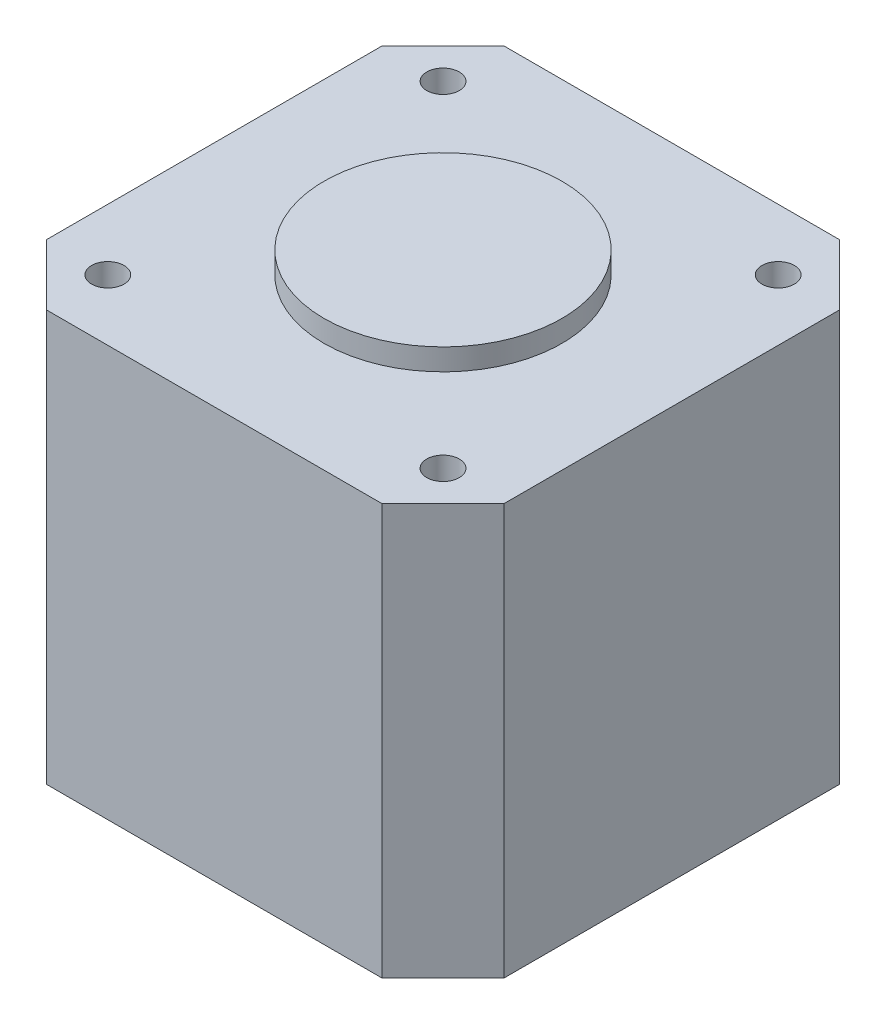
ISO-10303-21;
HEADER;
FILE_DESCRIPTION(('STEP AP214'),'2;1');
FILE_NAME('part.step','',(''),(''),'','','');
FILE_SCHEMA(('AUTOMOTIVE_DESIGN { 1 0 10303 214 1 1 1 1 }'));
ENDSEC;
DATA;
#1=APPLICATION_CONTEXT('core data for automotive mechanical design processes');
#2=APPLICATION_PROTOCOL_DEFINITION('international standard','automotive_design',2000,#1);
#3=PRODUCT_CONTEXT('',#1,'mechanical');
#4=PRODUCT('Part','Part','',(#3));
#5=PRODUCT_RELATED_PRODUCT_CATEGORY('part','',(#4));
#6=PRODUCT_DEFINITION_FORMATION('','',#4);
#7=PRODUCT_DEFINITION_CONTEXT('part definition',#1,'design');
#8=PRODUCT_DEFINITION('design','',#6,#7);
#9=PRODUCT_DEFINITION_SHAPE('','',#8);
#10=(LENGTH_UNIT() NAMED_UNIT(*) SI_UNIT(.MILLI.,.METRE.));
#11=(NAMED_UNIT(*) PLANE_ANGLE_UNIT() SI_UNIT($,.RADIAN.));
#12=(NAMED_UNIT(*) SI_UNIT($,.STERADIAN.) SOLID_ANGLE_UNIT());
#13=UNCERTAINTY_MEASURE_WITH_UNIT(LENGTH_MEASURE(1.E-05),#10,'distance_accuracy_value','');
#14=(GEOMETRIC_REPRESENTATION_CONTEXT(3) GLOBAL_UNCERTAINTY_ASSIGNED_CONTEXT((#13)) GLOBAL_UNIT_ASSIGNED_CONTEXT((#10,
#11,#12)) REPRESENTATION_CONTEXT('',''));
#15=CARTESIAN_POINT('',(0.,0.,0.));
#16=DIRECTION('',(0.,0.,1.));
#17=DIRECTION('',(1.,0.,0.));
#18=AXIS2_PLACEMENT_3D('',#15,#16,#17);
#19=CARTESIAN_POINT('',(-15.5,38.,-21.15));
#20=DIRECTION('',(0.,0.,1.));
#21=DIRECTION('',(1.,0.,0.));
#22=AXIS2_PLACEMENT_3D('',#19,#20,#21);
#23=PLANE('',#22);
#24=DIRECTION('',(-1.,0.,0.));
#25=VECTOR('',#24,1.);
#26=CARTESIAN_POINT('',(-15.5,0.,-21.15));
#27=LINE('',#26,#25);
#28=CARTESIAN_POINT('',(15.5,0.,-21.15));
#29=VERTEX_POINT('',#28);
#30=CARTESIAN_POINT('',(-15.5,0.,-21.15));
#31=VERTEX_POINT('',#30);
#32=EDGE_CURVE('E136',#29,#31,#27,.T.);
#33=ORIENTED_EDGE('',*,*,#32,.T.);
#34=DIRECTION('',(0.,-1.,0.));
#35=VECTOR('',#34,1.);
#36=CARTESIAN_POINT('',(-15.5,38.,-21.15));
#37=LINE('',#36,#35);
#38=CARTESIAN_POINT('',(-15.5,38.,-21.15));
#39=VERTEX_POINT('',#38);
#40=EDGE_CURVE('E41',#39,#31,#37,.T.);
#41=ORIENTED_EDGE('',*,*,#40,.F.);
#42=DIRECTION('',(-1.,0.,0.));
#43=VECTOR('',#42,1.);
#44=CARTESIAN_POINT('',(-15.5,38.,-21.15));
#45=LINE('',#44,#43);
#46=CARTESIAN_POINT('',(15.5,38.,-21.15));
#47=VERTEX_POINT('',#46);
#48=EDGE_CURVE('E151',#47,#39,#45,.T.);
#49=ORIENTED_EDGE('',*,*,#48,.F.);
#50=DIRECTION('',(0.,-1.,0.));
#51=VECTOR('',#50,1.);
#52=CARTESIAN_POINT('',(15.5,38.,-21.15));
#53=LINE('',#52,#51);
#54=EDGE_CURVE('E132',#47,#29,#53,.T.);
#55=ORIENTED_EDGE('',*,*,#54,.T.);
#56=EDGE_LOOP('',(#33,#41,#49,#55));
#57=FACE_BOUND('',#56,.T.);
#58=ADVANCED_FACE('F38',(#57),#23,.F.);
#59=CARTESIAN_POINT('',(-15.5,38.,-21.15));
#60=DIRECTION('',(0.707106781186548,0.,0.707106781186548));
#61=DIRECTION('',(0.707106781186548,0.,-0.707106781186548));
#62=AXIS2_PLACEMENT_3D('',#59,#60,#61);
#63=PLANE('',#62);
#64=DIRECTION('',(-0.707106781186547,0.,0.707106781186547));
#65=VECTOR('',#64,1.);
#66=CARTESIAN_POINT('',(-15.5,0.,-21.15));
#67=LINE('',#66,#65);
#68=CARTESIAN_POINT('',(-21.15,0.,-15.5));
#69=VERTEX_POINT('',#68);
#70=EDGE_CURVE('E139',#31,#69,#67,.T.);
#71=ORIENTED_EDGE('',*,*,#70,.T.);
#72=DIRECTION('',(0.,-1.,0.));
#73=VECTOR('',#72,1.);
#74=CARTESIAN_POINT('',(-21.15,38.,-15.5));
#75=LINE('',#74,#73);
#76=CARTESIAN_POINT('',(-21.15,38.,-15.5));
#77=VERTEX_POINT('',#76);
#78=EDGE_CURVE('E160',#77,#69,#75,.T.);
#79=ORIENTED_EDGE('',*,*,#78,.F.);
#80=DIRECTION('',(-0.707106781186547,0.,0.707106781186547));
#81=VECTOR('',#80,1.);
#82=CARTESIAN_POINT('',(-15.5,38.,-21.15));
#83=LINE('',#82,#81);
#84=EDGE_CURVE('E99',#39,#77,#83,.T.);
#85=ORIENTED_EDGE('',*,*,#84,.F.);
#86=ORIENTED_EDGE('',*,*,#40,.T.);
#87=EDGE_LOOP('',(#71,#79,#85,#86));
#88=FACE_BOUND('',#87,.T.);
#89=ADVANCED_FACE('F166',(#88),#63,.F.);
#90=CARTESIAN_POINT('',(-21.15,38.,-15.5));
#91=DIRECTION('',(1.,0.,0.));
#92=DIRECTION('',(0.,0.,-1.));
#93=AXIS2_PLACEMENT_3D('',#90,#91,#92);
#94=PLANE('',#93);
#95=DIRECTION('',(0.,0.,1.));
#96=VECTOR('',#95,1.);
#97=CARTESIAN_POINT('',(-21.15,0.,-15.5));
#98=LINE('',#97,#96);
#99=CARTESIAN_POINT('',(-21.15,0.,15.5));
#100=VERTEX_POINT('',#99);
#101=EDGE_CURVE('E142',#69,#100,#98,.T.);
#102=ORIENTED_EDGE('',*,*,#101,.T.);
#103=DIRECTION('',(0.,-1.,0.));
#104=VECTOR('',#103,1.);
#105=CARTESIAN_POINT('',(-21.15,38.,15.5));
#106=LINE('',#105,#104);
#107=CARTESIAN_POINT('',(-21.15,38.,15.5));
#108=VERTEX_POINT('',#107);
#109=EDGE_CURVE('E158',#108,#100,#106,.T.);
#110=ORIENTED_EDGE('',*,*,#109,.F.);
#111=DIRECTION('',(0.,0.,1.));
#112=VECTOR('',#111,1.);
#113=CARTESIAN_POINT('',(-21.15,38.,-15.5));
#114=LINE('',#113,#112);
#115=EDGE_CURVE('E181',#77,#108,#114,.T.);
#116=ORIENTED_EDGE('',*,*,#115,.F.);
#117=ORIENTED_EDGE('',*,*,#78,.T.);
#118=EDGE_LOOP('',(#102,#110,#116,#117));
#119=FACE_BOUND('',#118,.T.);
#120=ADVANCED_FACE('F175',(#119),#94,.F.);
#121=CARTESIAN_POINT('',(-21.15,38.,15.5));
#122=DIRECTION('',(0.707106781186547,0.,-0.707106781186548));
#123=DIRECTION('',(-0.707106781186548,0.,-0.707106781186547));
#124=AXIS2_PLACEMENT_3D('',#121,#122,#123);
#125=PLANE('',#124);
#126=DIRECTION('',(0.707106781186548,0.,0.707106781186547));
#127=VECTOR('',#126,1.);
#128=CARTESIAN_POINT('',(-21.15,0.,15.5));
#129=LINE('',#128,#127);
#130=CARTESIAN_POINT('',(-15.5,0.,21.15));
#131=VERTEX_POINT('',#130);
#132=EDGE_CURVE('E144',#100,#131,#129,.T.);
#133=ORIENTED_EDGE('',*,*,#132,.T.);
#134=DIRECTION('',(0.,-1.,0.));
#135=VECTOR('',#134,1.);
#136=CARTESIAN_POINT('',(-15.5,38.,21.15));
#137=LINE('',#136,#135);
#138=CARTESIAN_POINT('',(-15.5,38.,21.15));
#139=VERTEX_POINT('',#138);
#140=EDGE_CURVE('E155',#139,#131,#137,.T.);
#141=ORIENTED_EDGE('',*,*,#140,.F.);
#142=DIRECTION('',(0.707106781186548,0.,0.707106781186547));
#143=VECTOR('',#142,1.);
#144=CARTESIAN_POINT('',(-21.15,38.,15.5));
#145=LINE('',#144,#143);
#146=EDGE_CURVE('E180',#108,#139,#145,.T.);
#147=ORIENTED_EDGE('',*,*,#146,.F.);
#148=ORIENTED_EDGE('',*,*,#109,.T.);
#149=EDGE_LOOP('',(#133,#141,#147,#148));
#150=FACE_BOUND('',#149,.T.);
#151=ADVANCED_FACE('F178',(#150),#125,.F.);
#152=CARTESIAN_POINT('',(-15.5,38.,21.15));
#153=DIRECTION('',(0.,0.,-1.));
#154=DIRECTION('',(-1.,0.,0.));
#155=AXIS2_PLACEMENT_3D('',#152,#153,#154);
#156=PLANE('',#155);
#157=DIRECTION('',(1.,0.,0.));
#158=VECTOR('',#157,1.);
#159=CARTESIAN_POINT('',(-15.5,0.,21.15));
#160=LINE('',#159,#158);
#161=CARTESIAN_POINT('',(15.5,0.,21.15));
#162=VERTEX_POINT('',#161);
#163=EDGE_CURVE('E146',#131,#162,#160,.T.);
#164=ORIENTED_EDGE('',*,*,#163,.T.);
#165=DIRECTION('',(0.,-1.,0.));
#166=VECTOR('',#165,1.);
#167=CARTESIAN_POINT('',(15.5,38.,21.15));
#168=LINE('',#167,#166);
#169=CARTESIAN_POINT('',(15.5,38.,21.15));
#170=VERTEX_POINT('',#169);
#171=EDGE_CURVE('E127',#170,#162,#168,.T.);
#172=ORIENTED_EDGE('',*,*,#171,.F.);
#173=DIRECTION('',(1.,0.,0.));
#174=VECTOR('',#173,1.);
#175=CARTESIAN_POINT('',(-15.5,38.,21.15));
#176=LINE('',#175,#174);
#177=EDGE_CURVE('E118',#139,#170,#176,.T.);
#178=ORIENTED_EDGE('',*,*,#177,.F.);
#179=ORIENTED_EDGE('',*,*,#140,.T.);
#180=EDGE_LOOP('',(#164,#172,#178,#179));
#181=FACE_BOUND('',#180,.T.);
#182=ADVANCED_FACE('F257',(#181),#156,.F.);
#183=CARTESIAN_POINT('',(15.5,38.,21.15));
#184=DIRECTION('',(-0.707106781186548,0.,-0.707106781186547));
#185=DIRECTION('',(-0.707106781186547,0.,0.707106781186548));
#186=AXIS2_PLACEMENT_3D('',#183,#184,#185);
#187=PLANE('',#186);
#188=DIRECTION('',(0.707106781186547,0.,-0.707106781186548));
#189=VECTOR('',#188,1.);
#190=CARTESIAN_POINT('',(15.5,0.,21.15));
#191=LINE('',#190,#189);
#192=CARTESIAN_POINT('',(21.15,0.,15.5));
#193=VERTEX_POINT('',#192);
#194=EDGE_CURVE('E126',#162,#193,#191,.T.);
#195=ORIENTED_EDGE('',*,*,#194,.T.);
#196=DIRECTION('',(0.,-1.,0.));
#197=VECTOR('',#196,1.);
#198=CARTESIAN_POINT('',(21.15,38.,15.5));
#199=LINE('',#198,#197);
#200=CARTESIAN_POINT('',(21.15,38.,15.5));
#201=VERTEX_POINT('',#200);
#202=EDGE_CURVE('E123',#201,#193,#199,.T.);
#203=ORIENTED_EDGE('',*,*,#202,.F.);
#204=DIRECTION('',(0.707106781186547,0.,-0.707106781186548));
#205=VECTOR('',#204,1.);
#206=CARTESIAN_POINT('',(15.5,38.,21.15));
#207=LINE('',#206,#205);
#208=EDGE_CURVE('E112',#170,#201,#207,.T.);
#209=ORIENTED_EDGE('',*,*,#208,.F.);
#210=ORIENTED_EDGE('',*,*,#171,.T.);
#211=EDGE_LOOP('',(#195,#203,#209,#210));
#212=FACE_BOUND('',#211,.T.);
#213=ADVANCED_FACE('F124',(#212),#187,.F.);
#214=CARTESIAN_POINT('',(21.15,38.,-15.5));
#215=DIRECTION('',(-1.,0.,0.));
#216=DIRECTION('',(0.,0.,1.));
#217=AXIS2_PLACEMENT_3D('',#214,#215,#216);
#218=PLANE('',#217);
#219=DIRECTION('',(0.,0.,-1.));
#220=VECTOR('',#219,1.);
#221=CARTESIAN_POINT('',(21.15,0.,-15.5));
#222=LINE('',#221,#220);
#223=CARTESIAN_POINT('',(21.15,0.,-15.5));
#224=VERTEX_POINT('',#223);
#225=EDGE_CURVE('E84',#193,#224,#222,.T.);
#226=ORIENTED_EDGE('',*,*,#225,.T.);
#227=DIRECTION('',(0.,-1.,0.));
#228=VECTOR('',#227,1.);
#229=CARTESIAN_POINT('',(21.15,38.,-15.5));
#230=LINE('',#229,#228);
#231=CARTESIAN_POINT('',(21.15,38.,-15.5));
#232=VERTEX_POINT('',#231);
#233=EDGE_CURVE('E128',#232,#224,#230,.T.);
#234=ORIENTED_EDGE('',*,*,#233,.F.);
#235=DIRECTION('',(0.,0.,-1.));
#236=VECTOR('',#235,1.);
#237=CARTESIAN_POINT('',(21.15,38.,-15.5));
#238=LINE('',#237,#236);
#239=EDGE_CURVE('E116',#201,#232,#238,.T.);
#240=ORIENTED_EDGE('',*,*,#239,.F.);
#241=ORIENTED_EDGE('',*,*,#202,.T.);
#242=EDGE_LOOP('',(#226,#234,#240,#241));
#243=FACE_BOUND('',#242,.T.);
#244=ADVANCED_FACE('F130',(#243),#218,.F.);
#245=CARTESIAN_POINT('',(15.5,38.,-21.15));
#246=DIRECTION('',(-0.707106781186548,0.,0.707106781186548));
#247=DIRECTION('',(0.707106781186548,0.,0.707106781186547));
#248=AXIS2_PLACEMENT_3D('',#245,#246,#247);
#249=PLANE('',#248);
#250=DIRECTION('',(-0.707106781186548,0.,-0.707106781186547));
#251=VECTOR('',#250,1.);
#252=CARTESIAN_POINT('',(15.5,0.,-21.15));
#253=LINE('',#252,#251);
#254=EDGE_CURVE('E90',#224,#29,#253,.T.);
#255=ORIENTED_EDGE('',*,*,#254,.T.);
#256=ORIENTED_EDGE('',*,*,#54,.F.);
#257=DIRECTION('',(-0.707106781186548,0.,-0.707106781186547));
#258=VECTOR('',#257,1.);
#259=CARTESIAN_POINT('',(15.5,38.,-21.15));
#260=LINE('',#259,#258);
#261=EDGE_CURVE('E55',#232,#47,#260,.T.);
#262=ORIENTED_EDGE('',*,*,#261,.F.);
#263=ORIENTED_EDGE('',*,*,#233,.T.);
#264=EDGE_LOOP('',(#255,#256,#262,#263));
#265=FACE_BOUND('',#264,.T.);
#266=ADVANCED_FACE('F225',(#265),#249,.F.);
#267=CARTESIAN_POINT('',(0.,38.,0.));
#268=DIRECTION('',(0.,-1.,0.));
#269=DIRECTION('',(0.,0.,-1.));
#270=AXIS2_PLACEMENT_3D('',#267,#268,#269);
#271=PLANE('',#270);
#272=CARTESIAN_POINT('',(-15.5,38.,15.5));
#273=DIRECTION('',(0.,1.,0.));
#274=DIRECTION('',(0.,0.,1.));
#275=AXIS2_PLACEMENT_3D('',#272,#273,#274);
#276=CIRCLE('',#275,1.5);
#277=CARTESIAN_POINT('',(-15.5,38.,17.));
#278=VERTEX_POINT('',#277);
#279=EDGE_CURVE('E196',#278,#278,#276,.T.);
#280=ORIENTED_EDGE('',*,*,#279,.F.);
#281=EDGE_LOOP('',(#280));
#282=FACE_BOUND('',#281,.T.);
#283=CARTESIAN_POINT('',(15.5,38.,15.5));
#284=DIRECTION('',(0.,1.,0.));
#285=DIRECTION('',(0.,0.,1.));
#286=AXIS2_PLACEMENT_3D('',#283,#284,#285);
#287=CIRCLE('',#286,1.5);
#288=CARTESIAN_POINT('',(15.5,38.,17.));
#289=VERTEX_POINT('',#288);
#290=EDGE_CURVE('E202',#289,#289,#287,.T.);
#291=ORIENTED_EDGE('',*,*,#290,.F.);
#292=EDGE_LOOP('',(#291));
#293=FACE_BOUND('',#292,.T.);
#294=CARTESIAN_POINT('',(15.5,38.,-15.5));
#295=DIRECTION('',(0.,1.,0.));
#296=DIRECTION('',(0.,0.,1.));
#297=AXIS2_PLACEMENT_3D('',#294,#295,#296);
#298=CIRCLE('',#297,1.5);
#299=CARTESIAN_POINT('',(15.5,38.,-14.));
#300=VERTEX_POINT('',#299);
#301=EDGE_CURVE('E208',#300,#300,#298,.T.);
#302=ORIENTED_EDGE('',*,*,#301,.F.);
#303=EDGE_LOOP('',(#302));
#304=FACE_BOUND('',#303,.T.);
#305=CARTESIAN_POINT('',(-15.5,38.,-15.5));
#306=DIRECTION('',(0.,1.,0.));
#307=DIRECTION('',(0.,0.,1.));
#308=AXIS2_PLACEMENT_3D('',#305,#306,#307);
#309=CIRCLE('',#308,1.5);
#310=CARTESIAN_POINT('',(-15.5,38.,-14.));
#311=VERTEX_POINT('',#310);
#312=EDGE_CURVE('E190',#311,#311,#309,.T.);
#313=ORIENTED_EDGE('',*,*,#312,.F.);
#314=EDGE_LOOP('',(#313));
#315=FACE_BOUND('',#314,.T.);
#316=CARTESIAN_POINT('',(0.,38.,0.));
#317=DIRECTION('',(0.,1.,0.));
#318=DIRECTION('',(0.,0.,1.));
#319=AXIS2_PLACEMENT_3D('',#316,#317,#318);
#320=CIRCLE('',#319,11.);
#321=CARTESIAN_POINT('',(0.,38.,11.));
#322=VERTEX_POINT('',#321);
#323=EDGE_CURVE('E11',#322,#322,#320,.T.);
#324=ORIENTED_EDGE('',*,*,#323,.F.);
#325=EDGE_LOOP('',(#324));
#326=FACE_BOUND('',#325,.T.);
#327=ORIENTED_EDGE('',*,*,#48,.T.);
#328=ORIENTED_EDGE('',*,*,#84,.T.);
#329=ORIENTED_EDGE('',*,*,#115,.T.);
#330=ORIENTED_EDGE('',*,*,#146,.T.);
#331=ORIENTED_EDGE('',*,*,#177,.T.);
#332=ORIENTED_EDGE('',*,*,#208,.T.);
#333=ORIENTED_EDGE('',*,*,#239,.T.);
#334=ORIENTED_EDGE('',*,*,#261,.T.);
#335=EDGE_LOOP('',(#327,#328,#329,#330,#331,#332,#333,#334));
#336=FACE_BOUND('',#335,.T.);
#337=ADVANCED_FACE('F114',(#282,#293,#304,#315,#326,#336),#271,.F.);
#338=CARTESIAN_POINT('',(0.,0.,0.));
#339=DIRECTION('',(0.,-1.,0.));
#340=DIRECTION('',(0.,0.,-1.));
#341=AXIS2_PLACEMENT_3D('',#338,#339,#340);
#342=PLANE('',#341);
#343=ORIENTED_EDGE('',*,*,#32,.F.);
#344=ORIENTED_EDGE('',*,*,#254,.F.);
#345=ORIENTED_EDGE('',*,*,#225,.F.);
#346=ORIENTED_EDGE('',*,*,#194,.F.);
#347=ORIENTED_EDGE('',*,*,#163,.F.);
#348=ORIENTED_EDGE('',*,*,#132,.F.);
#349=ORIENTED_EDGE('',*,*,#101,.F.);
#350=ORIENTED_EDGE('',*,*,#70,.F.);
#351=EDGE_LOOP('',(#343,#344,#345,#346,#347,#348,#349,#350));
#352=FACE_BOUND('',#351,.T.);
#353=ADVANCED_FACE('F171',(#352),#342,.T.);
#354=CARTESIAN_POINT('',(0.,40.,0.));
#355=DIRECTION('',(0.,-1.,0.));
#356=DIRECTION('',(0.,0.,-1.));
#357=AXIS2_PLACEMENT_3D('',#354,#355,#356);
#358=CYLINDRICAL_SURFACE('',#357,11.);
#359=CARTESIAN_POINT('',(0.,40.,0.));
#360=DIRECTION('',(0.,1.,0.));
#361=DIRECTION('',(0.,0.,1.));
#362=AXIS2_PLACEMENT_3D('',#359,#360,#361);
#363=CIRCLE('',#362,11.);
#364=CARTESIAN_POINT('',(0.,40.,11.));
#365=VERTEX_POINT('',#364);
#366=EDGE_CURVE('E140',#365,#365,#363,.T.);
#367=ORIENTED_EDGE('',*,*,#366,.F.);
#368=EDGE_LOOP('',(#367));
#369=FACE_BOUND('',#368,.T.);
#370=ORIENTED_EDGE('',*,*,#323,.T.);
#371=EDGE_LOOP('',(#370));
#372=FACE_BOUND('',#371,.T.);
#373=ADVANCED_FACE('F232',(#369,#372),#358,.T.);
#374=CARTESIAN_POINT('',(0.,40.,0.));
#375=DIRECTION('',(0.,1.,0.));
#376=DIRECTION('',(0.,0.,1.));
#377=AXIS2_PLACEMENT_3D('',#374,#375,#376);
#378=PLANE('',#377);
#379=ORIENTED_EDGE('',*,*,#366,.T.);
#380=EDGE_LOOP('',(#379));
#381=FACE_BOUND('',#380,.T.);
#382=ADVANCED_FACE('F234',(#381),#378,.T.);
#383=CARTESIAN_POINT('',(-15.5,33.,-15.5));
#384=DIRECTION('',(0.,1.,0.));
#385=DIRECTION('',(0.,0.,1.));
#386=AXIS2_PLACEMENT_3D('',#383,#384,#385);
#387=CYLINDRICAL_SURFACE('',#386,1.5);
#388=CARTESIAN_POINT('',(-15.5,33.,-15.5));
#389=DIRECTION('',(0.,1.,0.));
#390=DIRECTION('',(0.,0.,1.));
#391=AXIS2_PLACEMENT_3D('',#388,#389,#390);
#392=CIRCLE('',#391,1.5);
#393=CARTESIAN_POINT('',(-15.5,33.,-14.));
#394=VERTEX_POINT('',#393);
#395=EDGE_CURVE('E189',#394,#394,#392,.T.);
#396=ORIENTED_EDGE('',*,*,#395,.F.);
#397=EDGE_LOOP('',(#396));
#398=FACE_BOUND('',#397,.T.);
#399=ORIENTED_EDGE('',*,*,#312,.T.);
#400=EDGE_LOOP('',(#399));
#401=FACE_BOUND('',#400,.T.);
#402=ADVANCED_FACE('F241',(#398,#401),#387,.F.);
#403=CARTESIAN_POINT('',(-15.5,33.,-15.5));
#404=DIRECTION('',(0.,1.,0.));
#405=DIRECTION('',(0.,0.,1.));
#406=AXIS2_PLACEMENT_3D('',#403,#404,#405);
#407=PLANE('',#406);
#408=ORIENTED_EDGE('',*,*,#395,.T.);
#409=EDGE_LOOP('',(#408));
#410=FACE_BOUND('',#409,.T.);
#411=ADVANCED_FACE('F219',(#410),#407,.T.);
#412=CARTESIAN_POINT('',(15.5,33.,-15.5));
#413=DIRECTION('',(0.,1.,0.));
#414=DIRECTION('',(0.,0.,1.));
#415=AXIS2_PLACEMENT_3D('',#412,#413,#414);
#416=CYLINDRICAL_SURFACE('',#415,1.5);
#417=CARTESIAN_POINT('',(15.5,33.,-15.5));
#418=DIRECTION('',(0.,1.,0.));
#419=DIRECTION('',(0.,0.,1.));
#420=AXIS2_PLACEMENT_3D('',#417,#418,#419);
#421=CIRCLE('',#420,1.5);
#422=CARTESIAN_POINT('',(15.5,33.,-14.));
#423=VERTEX_POINT('',#422);
#424=EDGE_CURVE('E193',#423,#423,#421,.T.);
#425=ORIENTED_EDGE('',*,*,#424,.F.);
#426=EDGE_LOOP('',(#425));
#427=FACE_BOUND('',#426,.T.);
#428=ORIENTED_EDGE('',*,*,#301,.T.);
#429=EDGE_LOOP('',(#428));
#430=FACE_BOUND('',#429,.T.);
#431=ADVANCED_FACE('F216',(#427,#430),#416,.F.);
#432=CARTESIAN_POINT('',(15.5,33.,-15.5));
#433=DIRECTION('',(0.,1.,0.));
#434=DIRECTION('',(0.,0.,1.));
#435=AXIS2_PLACEMENT_3D('',#432,#433,#434);
#436=PLANE('',#435);
#437=ORIENTED_EDGE('',*,*,#424,.T.);
#438=EDGE_LOOP('',(#437));
#439=FACE_BOUND('',#438,.T.);
#440=ADVANCED_FACE('F214',(#439),#436,.T.);
#441=CARTESIAN_POINT('',(15.5,33.,15.5));
#442=DIRECTION('',(0.,1.,0.));
#443=DIRECTION('',(0.,0.,1.));
#444=AXIS2_PLACEMENT_3D('',#441,#442,#443);
#445=CYLINDRICAL_SURFACE('',#444,1.5);
#446=CARTESIAN_POINT('',(15.5,33.,15.5));
#447=DIRECTION('',(0.,1.,0.));
#448=DIRECTION('',(0.,0.,1.));
#449=AXIS2_PLACEMENT_3D('',#446,#447,#448);
#450=CIRCLE('',#449,1.5);
#451=CARTESIAN_POINT('',(15.5,33.,17.));
#452=VERTEX_POINT('',#451);
#453=EDGE_CURVE('E205',#452,#452,#450,.T.);
#454=ORIENTED_EDGE('',*,*,#453,.F.);
#455=EDGE_LOOP('',(#454));
#456=FACE_BOUND('',#455,.T.);
#457=ORIENTED_EDGE('',*,*,#290,.T.);
#458=EDGE_LOOP('',(#457));
#459=FACE_BOUND('',#458,.T.);
#460=ADVANCED_FACE('F356',(#456,#459),#445,.F.);
#461=CARTESIAN_POINT('',(15.5,33.,15.5));
#462=DIRECTION('',(0.,1.,0.));
#463=DIRECTION('',(0.,0.,1.));
#464=AXIS2_PLACEMENT_3D('',#461,#462,#463);
#465=PLANE('',#464);
#466=ORIENTED_EDGE('',*,*,#453,.T.);
#467=EDGE_LOOP('',(#466));
#468=FACE_BOUND('',#467,.T.);
#469=ADVANCED_FACE('F364',(#468),#465,.T.);
#470=CARTESIAN_POINT('',(-15.5,33.,15.5));
#471=DIRECTION('',(0.,1.,0.));
#472=DIRECTION('',(0.,0.,1.));
#473=AXIS2_PLACEMENT_3D('',#470,#471,#472);
#474=CYLINDRICAL_SURFACE('',#473,1.5);
#475=CARTESIAN_POINT('',(-15.5,33.,15.5));
#476=DIRECTION('',(0.,1.,0.));
#477=DIRECTION('',(0.,0.,1.));
#478=AXIS2_PLACEMENT_3D('',#475,#476,#477);
#479=CIRCLE('',#478,1.5);
#480=CARTESIAN_POINT('',(-15.5,33.,17.));
#481=VERTEX_POINT('',#480);
#482=EDGE_CURVE('E199',#481,#481,#479,.T.);
#483=ORIENTED_EDGE('',*,*,#482,.F.);
#484=EDGE_LOOP('',(#483));
#485=FACE_BOUND('',#484,.T.);
#486=ORIENTED_EDGE('',*,*,#279,.T.);
#487=EDGE_LOOP('',(#486));
#488=FACE_BOUND('',#487,.T.);
#489=ADVANCED_FACE('F373',(#485,#488),#474,.F.);
#490=CARTESIAN_POINT('',(-15.5,33.,15.5));
#491=DIRECTION('',(0.,1.,0.));
#492=DIRECTION('',(0.,0.,1.));
#493=AXIS2_PLACEMENT_3D('',#490,#491,#492);
#494=PLANE('',#493);
#495=ORIENTED_EDGE('',*,*,#482,.T.);
#496=EDGE_LOOP('',(#495));
#497=FACE_BOUND('',#496,.T.);
#498=ADVANCED_FACE('F382',(#497),#494,.T.);
#499=CLOSED_SHELL('',(#58,#89,#120,#151,#182,#213,#244,#266,#337,#353,#373,#382,#402,#411,#431,
#440,#460,#469,#489,#498));
#500=MANIFOLD_SOLID_BREP('B2',#499);
#501=ADVANCED_BREP_SHAPE_REPRESENTATION('',(#18,#500),#14);
#502=SHAPE_DEFINITION_REPRESENTATION(#9,#501);
ENDSEC;
END-ISO-10303-21;
